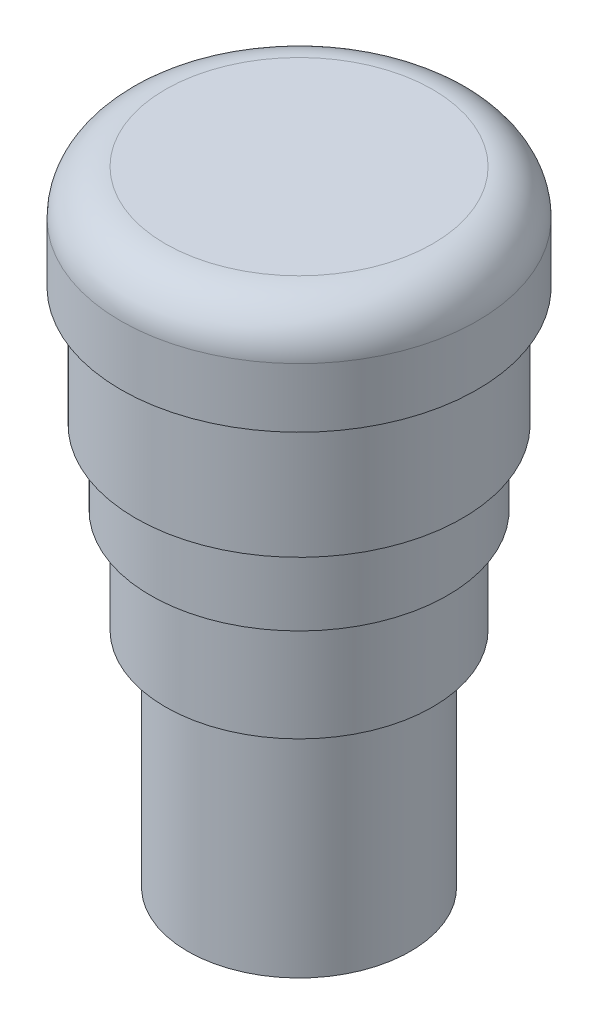
ISO-10303-21;
HEADER;
FILE_DESCRIPTION(('STEP AP214'),'2;1');
FILE_NAME('part.step','',(''),(''),'','','');
FILE_SCHEMA(('AUTOMOTIVE_DESIGN { 1 0 10303 214 1 1 1 1 }'));
ENDSEC;
DATA;
#1=APPLICATION_CONTEXT('core data for automotive mechanical design processes');
#2=APPLICATION_PROTOCOL_DEFINITION('international standard','automotive_design',2000,#1);
#3=PRODUCT_CONTEXT('',#1,'mechanical');
#4=PRODUCT('Part','Part','',(#3));
#5=PRODUCT_RELATED_PRODUCT_CATEGORY('part','',(#4));
#6=PRODUCT_DEFINITION_FORMATION('','',#4);
#7=PRODUCT_DEFINITION_CONTEXT('part definition',#1,'design');
#8=PRODUCT_DEFINITION('design','',#6,#7);
#9=PRODUCT_DEFINITION_SHAPE('','',#8);
#10=(LENGTH_UNIT() NAMED_UNIT(*) SI_UNIT(.MILLI.,.METRE.));
#11=(NAMED_UNIT(*) PLANE_ANGLE_UNIT() SI_UNIT($,.RADIAN.));
#12=(NAMED_UNIT(*) SI_UNIT($,.STERADIAN.) SOLID_ANGLE_UNIT());
#13=UNCERTAINTY_MEASURE_WITH_UNIT(LENGTH_MEASURE(1.E-05),#10,'distance_accuracy_value','');
#14=(GEOMETRIC_REPRESENTATION_CONTEXT(3) GLOBAL_UNCERTAINTY_ASSIGNED_CONTEXT((#13)) GLOBAL_UNIT_ASSIGNED_CONTEXT((#10,
#11,#12)) REPRESENTATION_CONTEXT('',''));
#15=CARTESIAN_POINT('',(0.,0.,0.));
#16=DIRECTION('',(0.,0.,1.));
#17=DIRECTION('',(1.,0.,0.));
#18=AXIS2_PLACEMENT_3D('',#15,#16,#17);
#19=CARTESIAN_POINT('',(0.,-20.,0.));
#20=DIRECTION('',(0.,-1.,0.));
#21=DIRECTION('',(0.,0.,-1.));
#22=AXIS2_PLACEMENT_3D('',#19,#20,#21);
#23=PLANE('',#22);
#24=CARTESIAN_POINT('',(0.,-20.,0.));
#25=DIRECTION('',(0.,-1.,0.));
#26=DIRECTION('',(0.,0.,-1.));
#27=AXIS2_PLACEMENT_3D('',#24,#25,#26);
#28=CIRCLE('',#27,9.);
#29=CARTESIAN_POINT('',(0.,-20.,-9.));
#30=VERTEX_POINT('',#29);
#31=EDGE_CURVE('E55',#30,#30,#28,.T.);
#32=ORIENTED_EDGE('',*,*,#31,.T.);
#33=EDGE_LOOP('',(#32));
#34=FACE_BOUND('',#33,.T.);
#35=CARTESIAN_POINT('',(0.,-20.,0.));
#36=DIRECTION('',(0.,-1.,0.));
#37=DIRECTION('',(0.,0.,-1.));
#38=AXIS2_PLACEMENT_3D('',#35,#36,#37);
#39=CIRCLE('',#38,7.5);
#40=CARTESIAN_POINT('',(0.,-20.,-7.5));
#41=VERTEX_POINT('',#40);
#42=EDGE_CURVE('E64',#41,#41,#39,.T.);
#43=ORIENTED_EDGE('',*,*,#42,.F.);
#44=EDGE_LOOP('',(#43));
#45=FACE_BOUND('',#44,.T.);
#46=ADVANCED_FACE('F28',(#34,#45),#23,.T.);
#47=CARTESIAN_POINT('',(0.,-13.,0.));
#48=DIRECTION('',(0.,-1.,0.));
#49=DIRECTION('',(0.,0.,-1.));
#50=AXIS2_PLACEMENT_3D('',#47,#48,#49);
#51=PLANE('',#50);
#52=CARTESIAN_POINT('',(0.,-13.,0.));
#53=DIRECTION('',(0.,-1.,0.));
#54=DIRECTION('',(0.,0.,-1.));
#55=AXIS2_PLACEMENT_3D('',#52,#53,#54);
#56=CIRCLE('',#55,10.);
#57=CARTESIAN_POINT('',(0.,-13.,-10.));
#58=VERTEX_POINT('',#57);
#59=EDGE_CURVE('E51',#58,#58,#56,.T.);
#60=ORIENTED_EDGE('',*,*,#59,.T.);
#61=EDGE_LOOP('',(#60));
#62=FACE_BOUND('',#61,.T.);
#63=CARTESIAN_POINT('',(0.,-13.,0.));
#64=DIRECTION('',(0.,-1.,0.));
#65=DIRECTION('',(0.,0.,-1.));
#66=AXIS2_PLACEMENT_3D('',#63,#64,#65);
#67=CIRCLE('',#66,9.);
#68=CARTESIAN_POINT('',(0.,-13.,-9.));
#69=VERTEX_POINT('',#68);
#70=EDGE_CURVE('E58',#69,#69,#67,.T.);
#71=ORIENTED_EDGE('',*,*,#70,.F.);
#72=EDGE_LOOP('',(#71));
#73=FACE_BOUND('',#72,.T.);
#74=ADVANCED_FACE('F80',(#62,#73),#51,.T.);
#75=CARTESIAN_POINT('',(0.,-8.,0.));
#76=DIRECTION('',(0.,-1.,0.));
#77=DIRECTION('',(0.,0.,-1.));
#78=AXIS2_PLACEMENT_3D('',#75,#76,#77);
#79=PLANE('',#78);
#80=CARTESIAN_POINT('',(0.,-8.,0.));
#81=DIRECTION('',(0.,-1.,0.));
#82=DIRECTION('',(0.,0.,-1.));
#83=AXIS2_PLACEMENT_3D('',#80,#81,#82);
#84=CIRCLE('',#83,11.);
#85=CARTESIAN_POINT('',(0.,-8.,-11.));
#86=VERTEX_POINT('',#85);
#87=EDGE_CURVE('E48',#86,#86,#84,.T.);
#88=ORIENTED_EDGE('',*,*,#87,.T.);
#89=EDGE_LOOP('',(#88));
#90=FACE_BOUND('',#89,.T.);
#91=CARTESIAN_POINT('',(0.,-8.,0.));
#92=DIRECTION('',(0.,-1.,0.));
#93=DIRECTION('',(0.,0.,-1.));
#94=AXIS2_PLACEMENT_3D('',#91,#92,#93);
#95=CIRCLE('',#94,10.);
#96=CARTESIAN_POINT('',(0.,-8.,-10.));
#97=VERTEX_POINT('',#96);
#98=EDGE_CURVE('E52',#97,#97,#95,.T.);
#99=ORIENTED_EDGE('',*,*,#98,.F.);
#100=EDGE_LOOP('',(#99));
#101=FACE_BOUND('',#100,.T.);
#102=ADVANCED_FACE('F86',(#90,#101),#79,.T.);
#103=CARTESIAN_POINT('',(0.,0.,0.));
#104=DIRECTION('',(0.,1.,0.));
#105=DIRECTION('',(0.,0.,1.));
#106=AXIS2_PLACEMENT_3D('',#103,#104,#105);
#107=PLANE('',#106);
#108=CARTESIAN_POINT('',(0.,0.,0.));
#109=DIRECTION('',(0.,1.,0.));
#110=DIRECTION('',(0.,0.,1.));
#111=AXIS2_PLACEMENT_3D('',#108,#109,#110);
#112=CIRCLE('',#111,12.);
#113=CARTESIAN_POINT('',(0.,0.,12.));
#114=VERTEX_POINT('',#113);
#115=EDGE_CURVE('E43',#114,#114,#112,.T.);
#116=ORIENTED_EDGE('',*,*,#115,.F.);
#117=EDGE_LOOP('',(#116));
#118=FACE_BOUND('',#117,.T.);
#119=CARTESIAN_POINT('',(0.,0.,0.));
#120=DIRECTION('',(0.,1.,0.));
#121=DIRECTION('',(0.,0.,1.));
#122=AXIS2_PLACEMENT_3D('',#119,#120,#121);
#123=CIRCLE('',#122,11.);
#124=CARTESIAN_POINT('',(0.,0.,11.));
#125=VERTEX_POINT('',#124);
#126=EDGE_CURVE('E39',#125,#125,#123,.F.);
#127=ORIENTED_EDGE('',*,*,#126,.F.);
#128=EDGE_LOOP('',(#127));
#129=FACE_BOUND('',#128,.T.);
#130=ADVANCED_FACE('F100',(#118,#129),#107,.F.);
#131=CARTESIAN_POINT('',(0.,7.,0.));
#132=DIRECTION('',(0.,-1.,0.));
#133=DIRECTION('',(0.,0.,-1.));
#134=AXIS2_PLACEMENT_3D('',#131,#132,#133);
#135=CYLINDRICAL_SURFACE('',#134,12.);
#136=CARTESIAN_POINT('',(0.,4.,0.));
#137=DIRECTION('',(0.,1.,0.));
#138=DIRECTION('',(0.,0.,1.));
#139=AXIS2_PLACEMENT_3D('',#136,#137,#138);
#140=CIRCLE('',#139,12.);
#141=CARTESIAN_POINT('',(0.,4.,12.));
#142=VERTEX_POINT('',#141);
#143=EDGE_CURVE('E10',#142,#142,#140,.F.);
#144=ORIENTED_EDGE('',*,*,#143,.T.);
#145=EDGE_LOOP('',(#144));
#146=FACE_BOUND('',#145,.T.);
#147=ORIENTED_EDGE('',*,*,#115,.T.);
#148=EDGE_LOOP('',(#147));
#149=FACE_BOUND('',#148,.T.);
#150=ADVANCED_FACE('F109',(#146,#149),#135,.T.);
#151=CARTESIAN_POINT('',(0.,7.,0.));
#152=DIRECTION('',(0.,1.,0.));
#153=DIRECTION('',(0.,0.,1.));
#154=AXIS2_PLACEMENT_3D('',#151,#152,#153);
#155=PLANE('',#154);
#156=CARTESIAN_POINT('',(0.,7.,0.));
#157=DIRECTION('',(0.,1.,0.));
#158=DIRECTION('',(0.,0.,1.));
#159=AXIS2_PLACEMENT_3D('',#156,#157,#158);
#160=CIRCLE('',#159,9.);
#161=CARTESIAN_POINT('',(0.,7.,9.));
#162=VERTEX_POINT('',#161);
#163=EDGE_CURVE('E35',#162,#162,#160,.T.);
#164=ORIENTED_EDGE('',*,*,#163,.T.);
#165=EDGE_LOOP('',(#164));
#166=FACE_BOUND('',#165,.T.);
#167=ADVANCED_FACE('F105',(#166),#155,.T.);
#168=CARTESIAN_POINT('',(0.,-8.,0.));
#169=DIRECTION('',(0.,1.,0.));
#170=DIRECTION('',(0.,0.,1.));
#171=AXIS2_PLACEMENT_3D('',#168,#169,#170);
#172=CYLINDRICAL_SURFACE('',#171,11.);
#173=ORIENTED_EDGE('',*,*,#87,.F.);
#174=EDGE_LOOP('',(#173));
#175=FACE_BOUND('',#174,.T.);
#176=ORIENTED_EDGE('',*,*,#126,.T.);
#177=EDGE_LOOP('',(#176));
#178=FACE_BOUND('',#177,.T.);
#179=ADVANCED_FACE('F102',(#175,#178),#172,.T.);
#180=CARTESIAN_POINT('',(0.,4.,0.));
#181=DIRECTION('',(0.,1.,0.));
#182=DIRECTION('',(0.,0.,1.));
#183=AXIS2_PLACEMENT_3D('',#180,#181,#182);
#184=TOROIDAL_SURFACE('',#183,9.,3.);
#185=ORIENTED_EDGE('',*,*,#143,.F.);
#186=EDGE_LOOP('',(#185));
#187=FACE_BOUND('',#186,.T.);
#188=ORIENTED_EDGE('',*,*,#163,.F.);
#189=EDGE_LOOP('',(#188));
#190=FACE_BOUND('',#189,.T.);
#191=ADVANCED_FACE('F30',(#187,#190),#184,.T.);
#192=CARTESIAN_POINT('',(0.,-13.,0.));
#193=DIRECTION('',(0.,1.,0.));
#194=DIRECTION('',(0.,0.,1.));
#195=AXIS2_PLACEMENT_3D('',#192,#193,#194);
#196=CYLINDRICAL_SURFACE('',#195,10.);
#197=ORIENTED_EDGE('',*,*,#59,.F.);
#198=EDGE_LOOP('',(#197));
#199=FACE_BOUND('',#198,.T.);
#200=ORIENTED_EDGE('',*,*,#98,.T.);
#201=EDGE_LOOP('',(#200));
#202=FACE_BOUND('',#201,.T.);
#203=ADVANCED_FACE('F92',(#199,#202),#196,.T.);
#204=CARTESIAN_POINT('',(0.,-20.,0.));
#205=DIRECTION('',(0.,1.,0.));
#206=DIRECTION('',(0.,0.,1.));
#207=AXIS2_PLACEMENT_3D('',#204,#205,#206);
#208=CYLINDRICAL_SURFACE('',#207,9.);
#209=ORIENTED_EDGE('',*,*,#31,.F.);
#210=EDGE_LOOP('',(#209));
#211=FACE_BOUND('',#210,.T.);
#212=ORIENTED_EDGE('',*,*,#70,.T.);
#213=EDGE_LOOP('',(#212));
#214=FACE_BOUND('',#213,.T.);
#215=ADVANCED_FACE('F75',(#211,#214),#208,.T.);
#216=CARTESIAN_POINT('',(0.,-35.,0.));
#217=DIRECTION('',(0.,1.,0.));
#218=DIRECTION('',(0.,0.,1.));
#219=AXIS2_PLACEMENT_3D('',#216,#217,#218);
#220=CYLINDRICAL_SURFACE('',#219,7.5);
#221=CARTESIAN_POINT('',(0.,-35.,0.));
#222=DIRECTION('',(0.,-1.,0.));
#223=DIRECTION('',(0.,0.,-1.));
#224=AXIS2_PLACEMENT_3D('',#221,#222,#223);
#225=CIRCLE('',#224,7.5);
#226=CARTESIAN_POINT('',(0.,-35.,-7.5));
#227=VERTEX_POINT('',#226);
#228=EDGE_CURVE('E61',#227,#227,#225,.T.);
#229=ORIENTED_EDGE('',*,*,#228,.F.);
#230=EDGE_LOOP('',(#229));
#231=FACE_BOUND('',#230,.T.);
#232=ORIENTED_EDGE('',*,*,#42,.T.);
#233=EDGE_LOOP('',(#232));
#234=FACE_BOUND('',#233,.T.);
#235=ADVANCED_FACE('F72',(#231,#234),#220,.T.);
#236=CARTESIAN_POINT('',(0.,-35.,0.));
#237=DIRECTION('',(0.,-1.,0.));
#238=DIRECTION('',(0.,0.,-1.));
#239=AXIS2_PLACEMENT_3D('',#236,#237,#238);
#240=PLANE('',#239);
#241=ORIENTED_EDGE('',*,*,#228,.T.);
#242=EDGE_LOOP('',(#241));
#243=FACE_BOUND('',#242,.T.);
#244=ADVANCED_FACE('F70',(#243),#240,.T.);
#245=CLOSED_SHELL('',(#46,#74,#102,#130,#150,#167,#179,#191,#203,#215,#235,#244));
#246=MANIFOLD_SOLID_BREP('B2',#245);
#247=ADVANCED_BREP_SHAPE_REPRESENTATION('',(#18,#246),#14);
#248=SHAPE_DEFINITION_REPRESENTATION(#9,#247);
ENDSEC;
END-ISO-10303-21;
